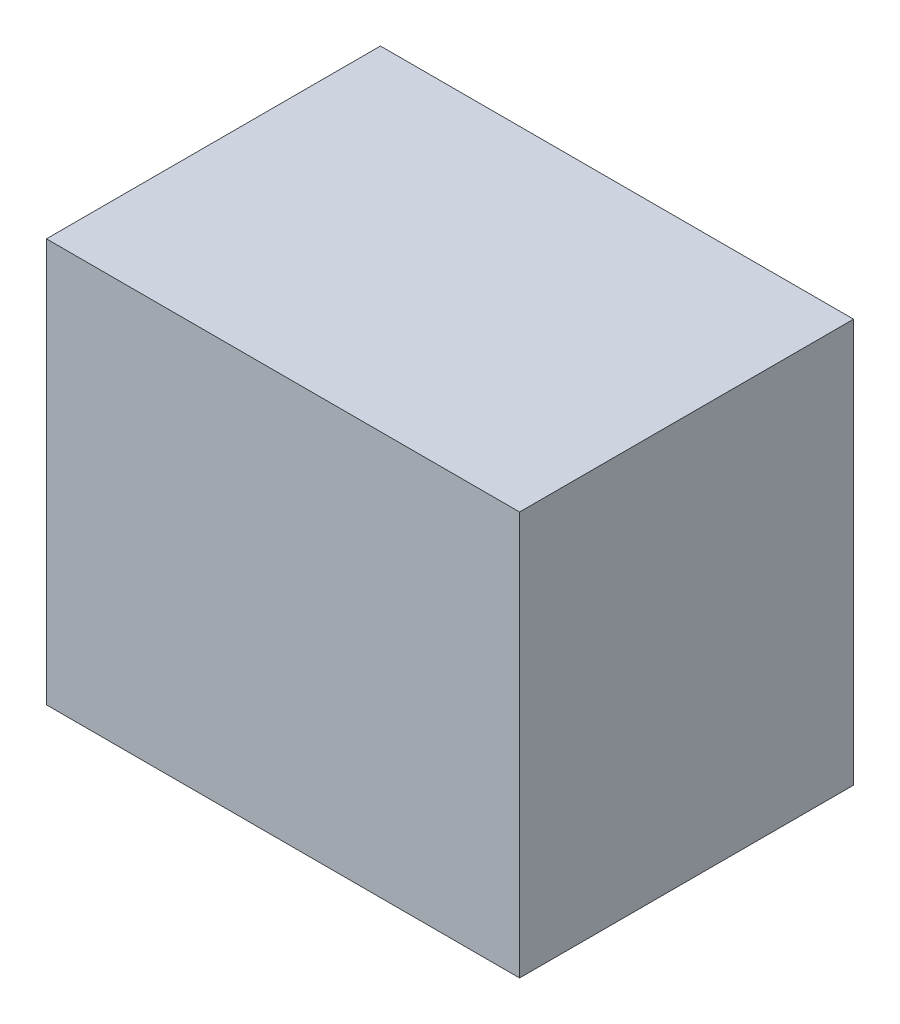
ISO-10303-21;
HEADER;
FILE_DESCRIPTION(('STEP AP214'),'2;1');
FILE_NAME('part.step','',(''),(''),'','','');
FILE_SCHEMA(('AUTOMOTIVE_DESIGN { 1 0 10303 214 1 1 1 1 }'));
ENDSEC;
DATA;
#1=APPLICATION_CONTEXT('core data for automotive mechanical design processes');
#2=APPLICATION_PROTOCOL_DEFINITION('international standard','automotive_design',2000,#1);
#3=PRODUCT_CONTEXT('',#1,'mechanical');
#4=PRODUCT('Part','Part','',(#3));
#5=PRODUCT_RELATED_PRODUCT_CATEGORY('part','',(#4));
#6=PRODUCT_DEFINITION_FORMATION('','',#4);
#7=PRODUCT_DEFINITION_CONTEXT('part definition',#1,'design');
#8=PRODUCT_DEFINITION('design','',#6,#7);
#9=PRODUCT_DEFINITION_SHAPE('','',#8);
#10=(LENGTH_UNIT() NAMED_UNIT(*) SI_UNIT(.MILLI.,.METRE.));
#11=(NAMED_UNIT(*) PLANE_ANGLE_UNIT() SI_UNIT($,.RADIAN.));
#12=(NAMED_UNIT(*) SI_UNIT($,.STERADIAN.) SOLID_ANGLE_UNIT());
#13=UNCERTAINTY_MEASURE_WITH_UNIT(LENGTH_MEASURE(1.E-05),#10,'distance_accuracy_value','');
#14=(GEOMETRIC_REPRESENTATION_CONTEXT(3) GLOBAL_UNCERTAINTY_ASSIGNED_CONTEXT((#13)) GLOBAL_UNIT_ASSIGNED_CONTEXT((#10,
#11,#12)) REPRESENTATION_CONTEXT('',''));
#15=CARTESIAN_POINT('',(0.,0.,0.));
#16=DIRECTION('',(0.,0.,1.));
#17=DIRECTION('',(1.,0.,0.));
#18=AXIS2_PLACEMENT_3D('',#15,#16,#17);
#19=CARTESIAN_POINT('',(170.,290.,120.));
#20=DIRECTION('',(-1.,0.,0.));
#21=DIRECTION('',(0.,0.,1.));
#22=AXIS2_PLACEMENT_3D('',#19,#20,#21);
#23=PLANE('',#22);
#24=DIRECTION('',(0.,0.,-1.));
#25=VECTOR('',#24,1.);
#26=CARTESIAN_POINT('',(170.,0.,120.));
#27=LINE('',#26,#25);
#28=CARTESIAN_POINT('',(170.,0.,120.));
#29=VERTEX_POINT('',#28);
#30=CARTESIAN_POINT('',(170.,0.,-120.));
#31=VERTEX_POINT('',#30);
#32=EDGE_CURVE('E111',#29,#31,#27,.T.);
#33=ORIENTED_EDGE('',*,*,#32,.T.);
#34=DIRECTION('',(0.,-1.,0.));
#35=VECTOR('',#34,1.);
#36=CARTESIAN_POINT('',(170.,290.,-120.));
#37=LINE('',#36,#35);
#38=CARTESIAN_POINT('',(170.,290.,-120.));
#39=VERTEX_POINT('',#38);
#40=EDGE_CURVE('E11',#39,#31,#37,.T.);
#41=ORIENTED_EDGE('',*,*,#40,.F.);
#42=DIRECTION('',(0.,0.,-1.));
#43=VECTOR('',#42,1.);
#44=CARTESIAN_POINT('',(170.,290.,120.));
#45=LINE('',#44,#43);
#46=CARTESIAN_POINT('',(170.,290.,120.));
#47=VERTEX_POINT('',#46);
#48=EDGE_CURVE('E95',#47,#39,#45,.T.);
#49=ORIENTED_EDGE('',*,*,#48,.F.);
#50=DIRECTION('',(0.,-1.,0.));
#51=VECTOR('',#50,1.);
#52=CARTESIAN_POINT('',(170.,290.,120.));
#53=LINE('',#52,#51);
#54=EDGE_CURVE('E107',#47,#29,#53,.T.);
#55=ORIENTED_EDGE('',*,*,#54,.T.);
#56=EDGE_LOOP('',(#33,#41,#49,#55));
#57=FACE_BOUND('',#56,.T.);
#58=ADVANCED_FACE('F43',(#57),#23,.F.);
#59=CARTESIAN_POINT('',(-170.,290.,-120.));
#60=DIRECTION('',(0.,0.,1.));
#61=DIRECTION('',(1.,0.,0.));
#62=AXIS2_PLACEMENT_3D('',#59,#60,#61);
#63=PLANE('',#62);
#64=DIRECTION('',(-1.,0.,0.));
#65=VECTOR('',#64,1.);
#66=CARTESIAN_POINT('',(-170.,0.,-120.));
#67=LINE('',#66,#65);
#68=CARTESIAN_POINT('',(-170.,0.,-120.));
#69=VERTEX_POINT('',#68);
#70=EDGE_CURVE('E100',#31,#69,#67,.T.);
#71=ORIENTED_EDGE('',*,*,#70,.T.);
#72=DIRECTION('',(0.,-1.,0.));
#73=VECTOR('',#72,1.);
#74=CARTESIAN_POINT('',(-170.,290.,-120.));
#75=LINE('',#74,#73);
#76=CARTESIAN_POINT('',(-170.,290.,-120.));
#77=VERTEX_POINT('',#76);
#78=EDGE_CURVE('E52',#77,#69,#75,.T.);
#79=ORIENTED_EDGE('',*,*,#78,.F.);
#80=DIRECTION('',(-1.,0.,0.));
#81=VECTOR('',#80,1.);
#82=CARTESIAN_POINT('',(-170.,290.,-120.));
#83=LINE('',#82,#81);
#84=EDGE_CURVE('E90',#39,#77,#83,.T.);
#85=ORIENTED_EDGE('',*,*,#84,.F.);
#86=ORIENTED_EDGE('',*,*,#40,.T.);
#87=EDGE_LOOP('',(#71,#79,#85,#86));
#88=FACE_BOUND('',#87,.T.);
#89=ADVANCED_FACE('F99',(#88),#63,.F.);
#90=CARTESIAN_POINT('',(-170.,290.,120.));
#91=DIRECTION('',(1.,0.,0.));
#92=DIRECTION('',(0.,0.,-1.));
#93=AXIS2_PLACEMENT_3D('',#90,#91,#92);
#94=PLANE('',#93);
#95=DIRECTION('',(0.,0.,1.));
#96=VECTOR('',#95,1.);
#97=CARTESIAN_POINT('',(-170.,0.,120.));
#98=LINE('',#97,#96);
#99=CARTESIAN_POINT('',(-170.,0.,120.));
#100=VERTEX_POINT('',#99);
#101=EDGE_CURVE('E77',#69,#100,#98,.T.);
#102=ORIENTED_EDGE('',*,*,#101,.T.);
#103=DIRECTION('',(0.,-1.,0.));
#104=VECTOR('',#103,1.);
#105=CARTESIAN_POINT('',(-170.,290.,120.));
#106=LINE('',#105,#104);
#107=CARTESIAN_POINT('',(-170.,290.,120.));
#108=VERTEX_POINT('',#107);
#109=EDGE_CURVE('E102',#108,#100,#106,.T.);
#110=ORIENTED_EDGE('',*,*,#109,.F.);
#111=DIRECTION('',(0.,0.,1.));
#112=VECTOR('',#111,1.);
#113=CARTESIAN_POINT('',(-170.,290.,120.));
#114=LINE('',#113,#112);
#115=EDGE_CURVE('E93',#77,#108,#114,.T.);
#116=ORIENTED_EDGE('',*,*,#115,.F.);
#117=ORIENTED_EDGE('',*,*,#78,.T.);
#118=EDGE_LOOP('',(#102,#110,#116,#117));
#119=FACE_BOUND('',#118,.T.);
#120=ADVANCED_FACE('F103',(#119),#94,.F.);
#121=CARTESIAN_POINT('',(-170.,290.,120.));
#122=DIRECTION('',(0.,0.,-1.));
#123=DIRECTION('',(-1.,0.,0.));
#124=AXIS2_PLACEMENT_3D('',#121,#122,#123);
#125=PLANE('',#124);
#126=DIRECTION('',(1.,0.,0.));
#127=VECTOR('',#126,1.);
#128=CARTESIAN_POINT('',(-170.,0.,120.));
#129=LINE('',#128,#127);
#130=EDGE_CURVE('E83',#100,#29,#129,.T.);
#131=ORIENTED_EDGE('',*,*,#130,.T.);
#132=ORIENTED_EDGE('',*,*,#54,.F.);
#133=DIRECTION('',(1.,0.,0.));
#134=VECTOR('',#133,1.);
#135=CARTESIAN_POINT('',(-170.,290.,120.));
#136=LINE('',#135,#134);
#137=EDGE_CURVE('E60',#108,#47,#136,.T.);
#138=ORIENTED_EDGE('',*,*,#137,.F.);
#139=ORIENTED_EDGE('',*,*,#109,.T.);
#140=EDGE_LOOP('',(#131,#132,#138,#139));
#141=FACE_BOUND('',#140,.T.);
#142=ADVANCED_FACE('F124',(#141),#125,.F.);
#143=CARTESIAN_POINT('',(0.,290.,0.));
#144=DIRECTION('',(0.,-1.,0.));
#145=DIRECTION('',(0.,0.,-1.));
#146=AXIS2_PLACEMENT_3D('',#143,#144,#145);
#147=PLANE('',#146);
#148=ORIENTED_EDGE('',*,*,#48,.T.);
#149=ORIENTED_EDGE('',*,*,#84,.T.);
#150=ORIENTED_EDGE('',*,*,#115,.T.);
#151=ORIENTED_EDGE('',*,*,#137,.T.);
#152=EDGE_LOOP('',(#148,#149,#150,#151));
#153=FACE_BOUND('',#152,.T.);
#154=ADVANCED_FACE('F91',(#153),#147,.F.);
#155=CARTESIAN_POINT('',(0.,0.,0.));
#156=DIRECTION('',(0.,-1.,0.));
#157=DIRECTION('',(0.,0.,-1.));
#158=AXIS2_PLACEMENT_3D('',#155,#156,#157);
#159=PLANE('',#158);
#160=ORIENTED_EDGE('',*,*,#32,.F.);
#161=ORIENTED_EDGE('',*,*,#130,.F.);
#162=ORIENTED_EDGE('',*,*,#101,.F.);
#163=ORIENTED_EDGE('',*,*,#70,.F.);
#164=EDGE_LOOP('',(#160,#161,#162,#163));
#165=FACE_BOUND('',#164,.T.);
#166=ADVANCED_FACE('F127',(#165),#159,.T.);
#167=CLOSED_SHELL('',(#58,#89,#120,#142,#154,#166));
#168=MANIFOLD_SOLID_BREP('B2',#167);
#169=ADVANCED_BREP_SHAPE_REPRESENTATION('',(#18,#168),#14);
#170=SHAPE_DEFINITION_REPRESENTATION(#9,#169);
ENDSEC;
END-ISO-10303-21;
